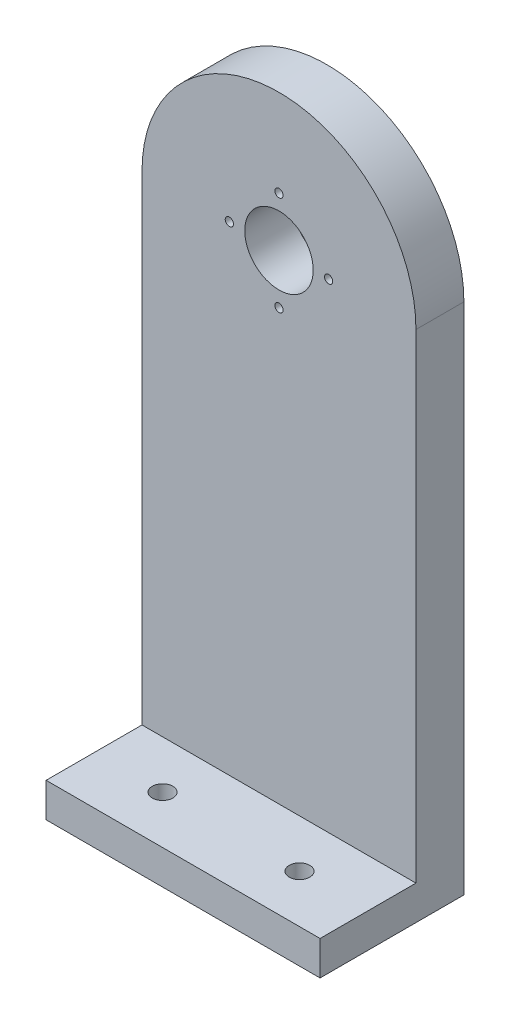
ISO-10303-21;
HEADER;
FILE_DESCRIPTION(('STEP AP214'),'2;1');
FILE_NAME('part.step','',(''),(''),'','','');
FILE_SCHEMA(('AUTOMOTIVE_DESIGN { 1 0 10303 214 1 1 1 1 }'));
ENDSEC;
DATA;
#1=APPLICATION_CONTEXT('core data for automotive mechanical design processes');
#2=APPLICATION_PROTOCOL_DEFINITION('international standard','automotive_design',2000,#1);
#3=PRODUCT_CONTEXT('',#1,'mechanical');
#4=PRODUCT('Part','Part','',(#3));
#5=PRODUCT_RELATED_PRODUCT_CATEGORY('part','',(#4));
#6=PRODUCT_DEFINITION_FORMATION('','',#4);
#7=PRODUCT_DEFINITION_CONTEXT('part definition',#1,'design');
#8=PRODUCT_DEFINITION('design','',#6,#7);
#9=PRODUCT_DEFINITION_SHAPE('','',#8);
#10=(LENGTH_UNIT() NAMED_UNIT(*) SI_UNIT(.MILLI.,.METRE.));
#11=(NAMED_UNIT(*) PLANE_ANGLE_UNIT() SI_UNIT($,.RADIAN.));
#12=(NAMED_UNIT(*) SI_UNIT($,.STERADIAN.) SOLID_ANGLE_UNIT());
#13=UNCERTAINTY_MEASURE_WITH_UNIT(LENGTH_MEASURE(1.E-05),#10,'distance_accuracy_value','');
#14=(GEOMETRIC_REPRESENTATION_CONTEXT(3) GLOBAL_UNCERTAINTY_ASSIGNED_CONTEXT((#13)) GLOBAL_UNIT_ASSIGNED_CONTEXT((#10,
#11,#12)) REPRESENTATION_CONTEXT('',''));
#15=CARTESIAN_POINT('',(0.,0.,0.));
#16=DIRECTION('',(0.,0.,1.));
#17=DIRECTION('',(1.,0.,0.));
#18=AXIS2_PLACEMENT_3D('',#15,#16,#17);
#19=CARTESIAN_POINT('',(0.,0.,7.));
#20=DIRECTION('',(0.,0.,1.));
#21=DIRECTION('',(1.,0.,0.));
#22=AXIS2_PLACEMENT_3D('',#19,#20,#21);
#23=PLANE('',#22);
#24=DIRECTION('',(-1.,0.,0.));
#25=VECTOR('',#24,1.);
#26=CARTESIAN_POINT('',(-20.,-70.,7.));
#27=LINE('',#26,#25);
#28=CARTESIAN_POINT('',(20.,-70.,7.));
#29=VERTEX_POINT('',#28);
#30=CARTESIAN_POINT('',(-20.,-70.,7.));
#31=VERTEX_POINT('',#30);
#32=EDGE_CURVE('E53',#29,#31,#27,.T.);
#33=ORIENTED_EDGE('',*,*,#32,.F.);
#34=DIRECTION('',(0.,1.,0.));
#35=VECTOR('',#34,1.);
#36=CARTESIAN_POINT('',(20.,0.,7.));
#37=LINE('',#36,#35);
#38=CARTESIAN_POINT('',(20.,0.,7.));
#39=VERTEX_POINT('',#38);
#40=EDGE_CURVE('E58',#29,#39,#37,.T.);
#41=ORIENTED_EDGE('',*,*,#40,.T.);
#42=CARTESIAN_POINT('',(0.,0.,7.));
#43=DIRECTION('',(0.,0.,1.));
#44=DIRECTION('',(1.,0.,0.));
#45=AXIS2_PLACEMENT_3D('',#42,#43,#44);
#46=CIRCLE('',#45,20.);
#47=CARTESIAN_POINT('',(-20.,0.,7.));
#48=VERTEX_POINT('',#47);
#49=EDGE_CURVE('E89',#39,#48,#46,.T.);
#50=ORIENTED_EDGE('',*,*,#49,.T.);
#51=DIRECTION('',(0.,-1.,0.));
#52=VECTOR('',#51,1.);
#53=CARTESIAN_POINT('',(-20.,0.,7.));
#54=LINE('',#53,#52);
#55=EDGE_CURVE('E114',#48,#31,#54,.T.);
#56=ORIENTED_EDGE('',*,*,#55,.T.);
#57=EDGE_LOOP('',(#33,#41,#50,#56));
#58=FACE_BOUND('',#57,.T.);
#59=CARTESIAN_POINT('',(0.,-7.25,7.));
#60=DIRECTION('',(0.,0.,1.));
#61=DIRECTION('',(1.,0.,0.));
#62=AXIS2_PLACEMENT_3D('',#59,#60,#61);
#63=CIRCLE('',#62,0.6);
#64=CARTESIAN_POINT('',(0.600000000000001,-7.25,7.));
#65=VERTEX_POINT('',#64);
#66=EDGE_CURVE('E132',#65,#65,#63,.T.);
#67=ORIENTED_EDGE('',*,*,#66,.F.);
#68=EDGE_LOOP('',(#67));
#69=FACE_BOUND('',#68,.T.);
#70=CARTESIAN_POINT('',(0.,7.25,7.));
#71=DIRECTION('',(0.,0.,1.));
#72=DIRECTION('',(1.,0.,0.));
#73=AXIS2_PLACEMENT_3D('',#70,#71,#72);
#74=CIRCLE('',#73,0.6);
#75=CARTESIAN_POINT('',(0.599999999999999,7.25,7.));
#76=VERTEX_POINT('',#75);
#77=EDGE_CURVE('E121',#76,#76,#74,.T.);
#78=ORIENTED_EDGE('',*,*,#77,.F.);
#79=EDGE_LOOP('',(#78));
#80=FACE_BOUND('',#79,.T.);
#81=CARTESIAN_POINT('',(0.,0.,7.));
#82=DIRECTION('',(0.,0.,1.));
#83=DIRECTION('',(1.,0.,0.));
#84=AXIS2_PLACEMENT_3D('',#81,#82,#83);
#85=CIRCLE('',#84,5.);
#86=CARTESIAN_POINT('',(5.,0.,7.));
#87=VERTEX_POINT('',#86);
#88=EDGE_CURVE('E100',#87,#87,#85,.T.);
#89=ORIENTED_EDGE('',*,*,#88,.F.);
#90=EDGE_LOOP('',(#89));
#91=FACE_BOUND('',#90,.T.);
#92=CARTESIAN_POINT('',(-7.25,0.,7.));
#93=DIRECTION('',(0.,0.,1.));
#94=DIRECTION('',(1.,0.,0.));
#95=AXIS2_PLACEMENT_3D('',#92,#93,#94);
#96=CIRCLE('',#95,0.6);
#97=CARTESIAN_POINT('',(-6.65,0.,7.));
#98=VERTEX_POINT('',#97);
#99=EDGE_CURVE('E126',#98,#98,#96,.T.);
#100=ORIENTED_EDGE('',*,*,#99,.F.);
#101=EDGE_LOOP('',(#100));
#102=FACE_BOUND('',#101,.T.);
#103=CARTESIAN_POINT('',(7.25,0.,7.));
#104=DIRECTION('',(0.,0.,1.));
#105=DIRECTION('',(1.,0.,0.));
#106=AXIS2_PLACEMENT_3D('',#103,#104,#105);
#107=CIRCLE('',#106,0.600000000000001);
#108=CARTESIAN_POINT('',(7.85,0.,7.));
#109=VERTEX_POINT('',#108);
#110=EDGE_CURVE('E138',#109,#109,#107,.T.);
#111=ORIENTED_EDGE('',*,*,#110,.F.);
#112=EDGE_LOOP('',(#111));
#113=FACE_BOUND('',#112,.T.);
#114=ADVANCED_FACE('F36',(#58,#69,#80,#91,#102,#113),#23,.T.);
#115=CARTESIAN_POINT('',(0.,0.,0.));
#116=DIRECTION('',(0.,0.,1.));
#117=DIRECTION('',(1.,0.,0.));
#118=AXIS2_PLACEMENT_3D('',#115,#116,#117);
#119=PLANE('',#118);
#120=CARTESIAN_POINT('',(0.,0.,0.));
#121=DIRECTION('',(0.,0.,1.));
#122=DIRECTION('',(1.,0.,0.));
#123=AXIS2_PLACEMENT_3D('',#120,#121,#122);
#124=CIRCLE('',#123,20.);
#125=CARTESIAN_POINT('',(20.,0.,0.));
#126=VERTEX_POINT('',#125);
#127=CARTESIAN_POINT('',(-20.,0.,0.));
#128=VERTEX_POINT('',#127);
#129=EDGE_CURVE('E95',#126,#128,#124,.T.);
#130=ORIENTED_EDGE('',*,*,#129,.F.);
#131=DIRECTION('',(0.,1.,0.));
#132=VECTOR('',#131,1.);
#133=CARTESIAN_POINT('',(20.,0.,0.));
#134=LINE('',#133,#132);
#135=CARTESIAN_POINT('',(20.,-75.,0.));
#136=VERTEX_POINT('',#135);
#137=EDGE_CURVE('E78',#136,#126,#134,.T.);
#138=ORIENTED_EDGE('',*,*,#137,.F.);
#139=DIRECTION('',(1.,0.,0.));
#140=VECTOR('',#139,1.);
#141=CARTESIAN_POINT('',(-20.,-75.,0.));
#142=LINE('',#141,#140);
#143=CARTESIAN_POINT('',(-20.,-75.,0.));
#144=VERTEX_POINT('',#143);
#145=EDGE_CURVE('E90',#144,#136,#142,.T.);
#146=ORIENTED_EDGE('',*,*,#145,.F.);
#147=DIRECTION('',(0.,-1.,0.));
#148=VECTOR('',#147,1.);
#149=CARTESIAN_POINT('',(-20.,0.,0.));
#150=LINE('',#149,#148);
#151=EDGE_CURVE('E99',#128,#144,#150,.T.);
#152=ORIENTED_EDGE('',*,*,#151,.F.);
#153=EDGE_LOOP('',(#130,#138,#146,#152));
#154=FACE_BOUND('',#153,.T.);
#155=CARTESIAN_POINT('',(0.,0.,0.));
#156=DIRECTION('',(0.,0.,1.));
#157=DIRECTION('',(1.,0.,0.));
#158=AXIS2_PLACEMENT_3D('',#155,#156,#157);
#159=CIRCLE('',#158,5.);
#160=CARTESIAN_POINT('',(5.,0.,0.));
#161=VERTEX_POINT('',#160);
#162=EDGE_CURVE('E104',#161,#161,#159,.T.);
#163=ORIENTED_EDGE('',*,*,#162,.T.);
#164=EDGE_LOOP('',(#163));
#165=FACE_BOUND('',#164,.T.);
#166=CARTESIAN_POINT('',(0.,7.25,0.));
#167=DIRECTION('',(0.,0.,1.));
#168=DIRECTION('',(1.,0.,0.));
#169=AXIS2_PLACEMENT_3D('',#166,#167,#168);
#170=CIRCLE('',#169,0.6);
#171=CARTESIAN_POINT('',(0.599999999999999,7.25,0.));
#172=VERTEX_POINT('',#171);
#173=EDGE_CURVE('E123',#172,#172,#170,.T.);
#174=ORIENTED_EDGE('',*,*,#173,.T.);
#175=EDGE_LOOP('',(#174));
#176=FACE_BOUND('',#175,.T.);
#177=CARTESIAN_POINT('',(-7.25,0.,0.));
#178=DIRECTION('',(0.,0.,1.));
#179=DIRECTION('',(1.,0.,0.));
#180=AXIS2_PLACEMENT_3D('',#177,#178,#179);
#181=CIRCLE('',#180,0.6);
#182=CARTESIAN_POINT('',(-6.65,0.,0.));
#183=VERTEX_POINT('',#182);
#184=EDGE_CURVE('E129',#183,#183,#181,.T.);
#185=ORIENTED_EDGE('',*,*,#184,.T.);
#186=EDGE_LOOP('',(#185));
#187=FACE_BOUND('',#186,.T.);
#188=CARTESIAN_POINT('',(0.,-7.25,0.));
#189=DIRECTION('',(0.,0.,1.));
#190=DIRECTION('',(1.,0.,0.));
#191=AXIS2_PLACEMENT_3D('',#188,#189,#190);
#192=CIRCLE('',#191,0.6);
#193=CARTESIAN_POINT('',(0.600000000000001,-7.25,0.));
#194=VERTEX_POINT('',#193);
#195=EDGE_CURVE('E135',#194,#194,#192,.T.);
#196=ORIENTED_EDGE('',*,*,#195,.T.);
#197=EDGE_LOOP('',(#196));
#198=FACE_BOUND('',#197,.T.);
#199=CARTESIAN_POINT('',(7.25,0.,0.));
#200=DIRECTION('',(0.,0.,1.));
#201=DIRECTION('',(1.,0.,0.));
#202=AXIS2_PLACEMENT_3D('',#199,#200,#201);
#203=CIRCLE('',#202,0.600000000000001);
#204=CARTESIAN_POINT('',(7.85,0.,0.));
#205=VERTEX_POINT('',#204);
#206=EDGE_CURVE('E141',#205,#205,#203,.T.);
#207=ORIENTED_EDGE('',*,*,#206,.T.);
#208=EDGE_LOOP('',(#207));
#209=FACE_BOUND('',#208,.T.);
#210=ADVANCED_FACE('F97',(#154,#165,#176,#187,#198,#209),#119,.F.);
#211=CARTESIAN_POINT('',(0.,0.,7.));
#212=DIRECTION('',(0.,0.,-1.));
#213=DIRECTION('',(-1.,0.,0.));
#214=AXIS2_PLACEMENT_3D('',#211,#212,#213);
#215=CYLINDRICAL_SURFACE('',#214,20.);
#216=ORIENTED_EDGE('',*,*,#129,.T.);
#217=DIRECTION('',(0.,0.,-1.));
#218=VECTOR('',#217,1.);
#219=CARTESIAN_POINT('',(-20.,0.,7.));
#220=LINE('',#219,#218);
#221=EDGE_CURVE('E11',#48,#128,#220,.T.);
#222=ORIENTED_EDGE('',*,*,#221,.F.);
#223=ORIENTED_EDGE('',*,*,#49,.F.);
#224=DIRECTION('',(0.,0.,-1.));
#225=VECTOR('',#224,1.);
#226=CARTESIAN_POINT('',(20.,0.,7.));
#227=LINE('',#226,#225);
#228=EDGE_CURVE('E81',#39,#126,#227,.T.);
#229=ORIENTED_EDGE('',*,*,#228,.T.);
#230=EDGE_LOOP('',(#216,#222,#223,#229));
#231=FACE_BOUND('',#230,.T.);
#232=ADVANCED_FACE('F38',(#231),#215,.T.);
#233=CARTESIAN_POINT('',(-20.,0.,7.));
#234=DIRECTION('',(1.,0.,0.));
#235=DIRECTION('',(0.,1.,0.));
#236=AXIS2_PLACEMENT_3D('',#233,#234,#235);
#237=PLANE('',#236);
#238=ORIENTED_EDGE('',*,*,#151,.T.);
#239=DIRECTION('',(0.,0.,-1.));
#240=VECTOR('',#239,1.);
#241=CARTESIAN_POINT('',(-20.,-75.,7.));
#242=LINE('',#241,#240);
#243=CARTESIAN_POINT('',(-20.,-75.,21.));
#244=VERTEX_POINT('',#243);
#245=EDGE_CURVE('E45',#244,#144,#242,.T.);
#246=ORIENTED_EDGE('',*,*,#245,.F.);
#247=DIRECTION('',(0.,-1.,0.));
#248=VECTOR('',#247,1.);
#249=CARTESIAN_POINT('',(-20.,-70.,21.));
#250=LINE('',#249,#248);
#251=CARTESIAN_POINT('',(-20.,-70.,21.));
#252=VERTEX_POINT('',#251);
#253=EDGE_CURVE('E152',#252,#244,#250,.T.);
#254=ORIENTED_EDGE('',*,*,#253,.F.);
#255=DIRECTION('',(0.,0.,-1.));
#256=VECTOR('',#255,1.);
#257=CARTESIAN_POINT('',(-20.,-70.,21.));
#258=LINE('',#257,#256);
#259=EDGE_CURVE('E154',#252,#31,#258,.T.);
#260=ORIENTED_EDGE('',*,*,#259,.T.);
#261=ORIENTED_EDGE('',*,*,#55,.F.);
#262=ORIENTED_EDGE('',*,*,#221,.T.);
#263=EDGE_LOOP('',(#238,#246,#254,#260,#261,#262));
#264=FACE_BOUND('',#263,.T.);
#265=ADVANCED_FACE('F181',(#264),#237,.F.);
#266=CARTESIAN_POINT('',(-20.,-75.,7.));
#267=DIRECTION('',(0.,1.,0.));
#268=DIRECTION('',(0.,0.,1.));
#269=AXIS2_PLACEMENT_3D('',#266,#267,#268);
#270=PLANE('',#269);
#271=CARTESIAN_POINT('',(10.,-75.,14.));
#272=DIRECTION('',(0.,1.,0.));
#273=DIRECTION('',(0.,0.,1.));
#274=AXIS2_PLACEMENT_3D('',#271,#272,#273);
#275=CIRCLE('',#274,1.5);
#276=CARTESIAN_POINT('',(10.,-75.,15.5));
#277=VERTEX_POINT('',#276);
#278=EDGE_CURVE('E193',#277,#277,#275,.T.);
#279=ORIENTED_EDGE('',*,*,#278,.T.);
#280=EDGE_LOOP('',(#279));
#281=FACE_BOUND('',#280,.T.);
#282=CARTESIAN_POINT('',(-10.,-75.,14.));
#283=DIRECTION('',(0.,1.,0.));
#284=DIRECTION('',(0.,0.,1.));
#285=AXIS2_PLACEMENT_3D('',#282,#283,#284);
#286=CIRCLE('',#285,1.5);
#287=CARTESIAN_POINT('',(-10.,-75.,15.5));
#288=VERTEX_POINT('',#287);
#289=EDGE_CURVE('E153',#288,#288,#286,.T.);
#290=ORIENTED_EDGE('',*,*,#289,.T.);
#291=EDGE_LOOP('',(#290));
#292=FACE_BOUND('',#291,.T.);
#293=ORIENTED_EDGE('',*,*,#145,.T.);
#294=DIRECTION('',(0.,0.,-1.));
#295=VECTOR('',#294,1.);
#296=CARTESIAN_POINT('',(20.,-75.,7.));
#297=LINE('',#296,#295);
#298=CARTESIAN_POINT('',(20.,-75.,21.));
#299=VERTEX_POINT('',#298);
#300=EDGE_CURVE('E85',#299,#136,#297,.T.);
#301=ORIENTED_EDGE('',*,*,#300,.F.);
#302=DIRECTION('',(1.,0.,0.));
#303=VECTOR('',#302,1.);
#304=CARTESIAN_POINT('',(-20.,-75.,21.));
#305=LINE('',#304,#303);
#306=EDGE_CURVE('E184',#244,#299,#305,.T.);
#307=ORIENTED_EDGE('',*,*,#306,.F.);
#308=ORIENTED_EDGE('',*,*,#245,.T.);
#309=EDGE_LOOP('',(#293,#301,#307,#308));
#310=FACE_BOUND('',#309,.T.);
#311=ADVANCED_FACE('F185',(#281,#292,#310),#270,.F.);
#312=CARTESIAN_POINT('',(20.,0.,7.));
#313=DIRECTION('',(-1.,0.,0.));
#314=DIRECTION('',(0.,-1.,0.));
#315=AXIS2_PLACEMENT_3D('',#312,#313,#314);
#316=PLANE('',#315);
#317=ORIENTED_EDGE('',*,*,#137,.T.);
#318=ORIENTED_EDGE('',*,*,#228,.F.);
#319=ORIENTED_EDGE('',*,*,#40,.F.);
#320=DIRECTION('',(0.,0.,-1.));
#321=VECTOR('',#320,1.);
#322=CARTESIAN_POINT('',(20.,-70.,21.));
#323=LINE('',#322,#321);
#324=CARTESIAN_POINT('',(20.,-70.,21.));
#325=VERTEX_POINT('',#324);
#326=EDGE_CURVE('E144',#325,#29,#323,.T.);
#327=ORIENTED_EDGE('',*,*,#326,.F.);
#328=DIRECTION('',(0.,1.,0.));
#329=VECTOR('',#328,1.);
#330=CARTESIAN_POINT('',(20.,-70.,21.));
#331=LINE('',#330,#329);
#332=EDGE_CURVE('E169',#299,#325,#331,.T.);
#333=ORIENTED_EDGE('',*,*,#332,.F.);
#334=ORIENTED_EDGE('',*,*,#300,.T.);
#335=EDGE_LOOP('',(#317,#318,#319,#327,#333,#334));
#336=FACE_BOUND('',#335,.T.);
#337=ADVANCED_FACE('F80',(#336),#316,.F.);
#338=CARTESIAN_POINT('',(0.,0.,7.));
#339=DIRECTION('',(0.,0.,-1.));
#340=DIRECTION('',(-1.,0.,0.));
#341=AXIS2_PLACEMENT_3D('',#338,#339,#340);
#342=CYLINDRICAL_SURFACE('',#341,5.);
#343=ORIENTED_EDGE('',*,*,#88,.T.);
#344=EDGE_LOOP('',(#343));
#345=FACE_BOUND('',#344,.T.);
#346=ORIENTED_EDGE('',*,*,#162,.F.);
#347=EDGE_LOOP('',(#346));
#348=FACE_BOUND('',#347,.T.);
#349=ADVANCED_FACE('F233',(#345,#348),#342,.F.);
#350=CARTESIAN_POINT('',(0.,7.25,7.));
#351=DIRECTION('',(0.,0.,-1.));
#352=DIRECTION('',(-1.,0.,0.));
#353=AXIS2_PLACEMENT_3D('',#350,#351,#352);
#354=CYLINDRICAL_SURFACE('',#353,0.6);
#355=ORIENTED_EDGE('',*,*,#77,.T.);
#356=EDGE_LOOP('',(#355));
#357=FACE_BOUND('',#356,.T.);
#358=ORIENTED_EDGE('',*,*,#173,.F.);
#359=EDGE_LOOP('',(#358));
#360=FACE_BOUND('',#359,.T.);
#361=ADVANCED_FACE('F286',(#357,#360),#354,.F.);
#362=CARTESIAN_POINT('',(-7.25,0.,7.));
#363=DIRECTION('',(0.,0.,-1.));
#364=DIRECTION('',(-1.,0.,0.));
#365=AXIS2_PLACEMENT_3D('',#362,#363,#364);
#366=CYLINDRICAL_SURFACE('',#365,0.6);
#367=ORIENTED_EDGE('',*,*,#99,.T.);
#368=EDGE_LOOP('',(#367));
#369=FACE_BOUND('',#368,.T.);
#370=ORIENTED_EDGE('',*,*,#184,.F.);
#371=EDGE_LOOP('',(#370));
#372=FACE_BOUND('',#371,.T.);
#373=ADVANCED_FACE('F294',(#369,#372),#366,.F.);
#374=CARTESIAN_POINT('',(0.,-7.25,7.));
#375=DIRECTION('',(0.,0.,-1.));
#376=DIRECTION('',(-1.,0.,0.));
#377=AXIS2_PLACEMENT_3D('',#374,#375,#376);
#378=CYLINDRICAL_SURFACE('',#377,0.6);
#379=ORIENTED_EDGE('',*,*,#66,.T.);
#380=EDGE_LOOP('',(#379));
#381=FACE_BOUND('',#380,.T.);
#382=ORIENTED_EDGE('',*,*,#195,.F.);
#383=EDGE_LOOP('',(#382));
#384=FACE_BOUND('',#383,.T.);
#385=ADVANCED_FACE('F302',(#381,#384),#378,.F.);
#386=CARTESIAN_POINT('',(7.25,0.,7.));
#387=DIRECTION('',(0.,0.,-1.));
#388=DIRECTION('',(-1.,0.,0.));
#389=AXIS2_PLACEMENT_3D('',#386,#387,#388);
#390=CYLINDRICAL_SURFACE('',#389,0.600000000000001);
#391=ORIENTED_EDGE('',*,*,#110,.T.);
#392=EDGE_LOOP('',(#391));
#393=FACE_BOUND('',#392,.T.);
#394=ORIENTED_EDGE('',*,*,#206,.F.);
#395=EDGE_LOOP('',(#394));
#396=FACE_BOUND('',#395,.T.);
#397=ADVANCED_FACE('F213',(#393,#396),#390,.F.);
#398=CARTESIAN_POINT('',(-20.,-70.,21.));
#399=DIRECTION('',(0.,-1.,0.));
#400=DIRECTION('',(0.,0.,-1.));
#401=AXIS2_PLACEMENT_3D('',#398,#399,#400);
#402=PLANE('',#401);
#403=CARTESIAN_POINT('',(10.,-70.,14.));
#404=DIRECTION('',(0.,1.,0.));
#405=DIRECTION('',(0.,0.,1.));
#406=AXIS2_PLACEMENT_3D('',#403,#404,#405);
#407=CIRCLE('',#406,1.5);
#408=CARTESIAN_POINT('',(10.,-70.,15.5));
#409=VERTEX_POINT('',#408);
#410=EDGE_CURVE('E196',#409,#409,#407,.T.);
#411=ORIENTED_EDGE('',*,*,#410,.F.);
#412=EDGE_LOOP('',(#411));
#413=FACE_BOUND('',#412,.T.);
#414=CARTESIAN_POINT('',(-10.,-70.,14.));
#415=DIRECTION('',(0.,1.,0.));
#416=DIRECTION('',(0.,0.,1.));
#417=AXIS2_PLACEMENT_3D('',#414,#415,#416);
#418=CIRCLE('',#417,1.5);
#419=CARTESIAN_POINT('',(-10.,-70.,15.5));
#420=VERTEX_POINT('',#419);
#421=EDGE_CURVE('E190',#420,#420,#418,.T.);
#422=ORIENTED_EDGE('',*,*,#421,.F.);
#423=EDGE_LOOP('',(#422));
#424=FACE_BOUND('',#423,.T.);
#425=ORIENTED_EDGE('',*,*,#32,.T.);
#426=ORIENTED_EDGE('',*,*,#259,.F.);
#427=DIRECTION('',(-1.,0.,0.));
#428=VECTOR('',#427,1.);
#429=CARTESIAN_POINT('',(-20.,-70.,21.));
#430=LINE('',#429,#428);
#431=EDGE_CURVE('E149',#325,#252,#430,.T.);
#432=ORIENTED_EDGE('',*,*,#431,.F.);
#433=ORIENTED_EDGE('',*,*,#326,.T.);
#434=EDGE_LOOP('',(#425,#426,#432,#433));
#435=FACE_BOUND('',#434,.T.);
#436=ADVANCED_FACE('F162',(#413,#424,#435),#402,.F.);
#437=CARTESIAN_POINT('',(0.,0.,21.));
#438=DIRECTION('',(0.,0.,1.));
#439=DIRECTION('',(1.,0.,0.));
#440=AXIS2_PLACEMENT_3D('',#437,#438,#439);
#441=PLANE('',#440);
#442=ORIENTED_EDGE('',*,*,#253,.T.);
#443=ORIENTED_EDGE('',*,*,#306,.T.);
#444=ORIENTED_EDGE('',*,*,#332,.T.);
#445=ORIENTED_EDGE('',*,*,#431,.T.);
#446=EDGE_LOOP('',(#442,#443,#444,#445));
#447=FACE_BOUND('',#446,.T.);
#448=ADVANCED_FACE('F187',(#447),#441,.T.);
#449=CARTESIAN_POINT('',(-10.,-75.,14.));
#450=DIRECTION('',(0.,1.,0.));
#451=DIRECTION('',(0.,0.,1.));
#452=AXIS2_PLACEMENT_3D('',#449,#450,#451);
#453=CYLINDRICAL_SURFACE('',#452,1.5);
#454=ORIENTED_EDGE('',*,*,#289,.F.);
#455=EDGE_LOOP('',(#454));
#456=FACE_BOUND('',#455,.T.);
#457=ORIENTED_EDGE('',*,*,#421,.T.);
#458=EDGE_LOOP('',(#457));
#459=FACE_BOUND('',#458,.T.);
#460=ADVANCED_FACE('F207',(#456,#459),#453,.F.);
#461=CARTESIAN_POINT('',(10.,-75.,14.));
#462=DIRECTION('',(0.,1.,0.));
#463=DIRECTION('',(0.,0.,1.));
#464=AXIS2_PLACEMENT_3D('',#461,#462,#463);
#465=CYLINDRICAL_SURFACE('',#464,1.5);
#466=ORIENTED_EDGE('',*,*,#278,.F.);
#467=EDGE_LOOP('',(#466));
#468=FACE_BOUND('',#467,.T.);
#469=ORIENTED_EDGE('',*,*,#410,.T.);
#470=EDGE_LOOP('',(#469));
#471=FACE_BOUND('',#470,.T.);
#472=ADVANCED_FACE('F204',(#468,#471),#465,.F.);
#473=CLOSED_SHELL('',(#114,#210,#232,#265,#311,#337,#349,#361,#373,#385,#397,#436,#448,#460,#472));
#474=MANIFOLD_SOLID_BREP('B2',#473);
#475=ADVANCED_BREP_SHAPE_REPRESENTATION('',(#18,#474),#14);
#476=SHAPE_DEFINITION_REPRESENTATION(#9,#475);
ENDSEC;
END-ISO-10303-21;
